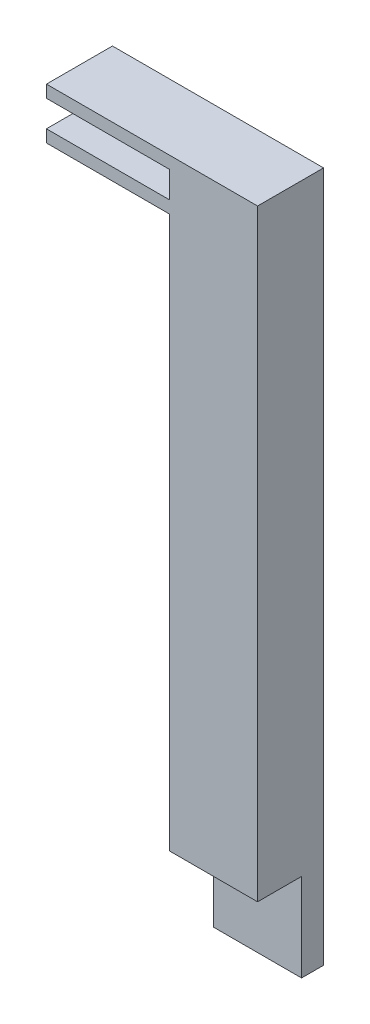
ISO-10303-21;
HEADER;
FILE_DESCRIPTION(('STEP AP214'),'2;1');
FILE_NAME('part.step','',(''),(''),'','','');
FILE_SCHEMA(('AUTOMOTIVE_DESIGN { 1 0 10303 214 1 1 1 1 }'));
ENDSEC;
DATA;
#1=APPLICATION_CONTEXT('core data for automotive mechanical design processes');
#2=APPLICATION_PROTOCOL_DEFINITION('international standard','automotive_design',2000,#1);
#3=PRODUCT_CONTEXT('',#1,'mechanical');
#4=PRODUCT('Part','Part','',(#3));
#5=PRODUCT_RELATED_PRODUCT_CATEGORY('part','',(#4));
#6=PRODUCT_DEFINITION_FORMATION('','',#4);
#7=PRODUCT_DEFINITION_CONTEXT('part definition',#1,'design');
#8=PRODUCT_DEFINITION('design','',#6,#7);
#9=PRODUCT_DEFINITION_SHAPE('','',#8);
#10=(LENGTH_UNIT() NAMED_UNIT(*) SI_UNIT(.MILLI.,.METRE.));
#11=(NAMED_UNIT(*) PLANE_ANGLE_UNIT() SI_UNIT($,.RADIAN.));
#12=(NAMED_UNIT(*) SI_UNIT($,.STERADIAN.) SOLID_ANGLE_UNIT());
#13=UNCERTAINTY_MEASURE_WITH_UNIT(LENGTH_MEASURE(1.E-05),#10,'distance_accuracy_value','');
#14=(GEOMETRIC_REPRESENTATION_CONTEXT(3) GLOBAL_UNCERTAINTY_ASSIGNED_CONTEXT((#13)) GLOBAL_UNIT_ASSIGNED_CONTEXT((#10,
#11,#12)) REPRESENTATION_CONTEXT('',''));
#15=CARTESIAN_POINT('',(0.,0.,0.));
#16=DIRECTION('',(0.,0.,1.));
#17=DIRECTION('',(1.,0.,0.));
#18=AXIS2_PLACEMENT_3D('',#15,#16,#17);
#19=CARTESIAN_POINT('',(-57.15,0.,0.));
#20=DIRECTION('',(1.,0.,0.));
#21=DIRECTION('',(0.,0.,-1.));
#22=AXIS2_PLACEMENT_3D('',#19,#20,#21);
#23=PLANE('',#22);
#24=DIRECTION('',(0.,0.,1.));
#25=VECTOR('',#24,1.);
#26=CARTESIAN_POINT('',(-57.15,108.458,19.05));
#27=LINE('',#26,#25);
#28=CARTESIAN_POINT('',(-57.15,108.458,0.));
#29=VERTEX_POINT('',#28);
#30=CARTESIAN_POINT('',(-57.15,108.458,19.05));
#31=VERTEX_POINT('',#30);
#32=EDGE_CURVE('E233',#29,#31,#27,.T.);
#33=ORIENTED_EDGE('',*,*,#32,.F.);
#34=DIRECTION('',(0.,-1.,0.));
#35=VECTOR('',#34,1.);
#36=CARTESIAN_POINT('',(-57.15,123.19,0.));
#37=LINE('',#36,#35);
#38=CARTESIAN_POINT('',(-57.15,-76.2,0.));
#39=VERTEX_POINT('',#38);
#40=EDGE_CURVE('E151',#29,#39,#37,.T.);
#41=ORIENTED_EDGE('',*,*,#40,.T.);
#42=DIRECTION('',(0.,0.,1.));
#43=VECTOR('',#42,1.);
#44=CARTESIAN_POINT('',(-57.15,-76.2,0.));
#45=LINE('',#44,#43);
#46=CARTESIAN_POINT('',(-57.15,-76.2,6.35));
#47=VERTEX_POINT('',#46);
#48=EDGE_CURVE('E182',#39,#47,#45,.T.);
#49=ORIENTED_EDGE('',*,*,#48,.T.);
#50=DIRECTION('',(0.,1.,0.));
#51=VECTOR('',#50,1.);
#52=CARTESIAN_POINT('',(-57.15,-76.2,6.35));
#53=LINE('',#52,#51);
#54=CARTESIAN_POINT('',(-57.15,-50.8,6.35));
#55=VERTEX_POINT('',#54);
#56=EDGE_CURVE('E184',#47,#55,#53,.T.);
#57=ORIENTED_EDGE('',*,*,#56,.T.);
#58=DIRECTION('',(0.,0.,1.));
#59=VECTOR('',#58,1.);
#60=CARTESIAN_POINT('',(-57.15,-50.8,6.35));
#61=LINE('',#60,#59);
#62=CARTESIAN_POINT('',(-57.15,-50.8,19.05));
#63=VERTEX_POINT('',#62);
#64=EDGE_CURVE('E186',#55,#63,#61,.T.);
#65=ORIENTED_EDGE('',*,*,#64,.T.);
#66=DIRECTION('',(0.,1.,0.));
#67=VECTOR('',#66,1.);
#68=CARTESIAN_POINT('',(-57.15,-50.8,19.05));
#69=LINE('',#68,#67);
#70=EDGE_CURVE('E62',#63,#31,#69,.T.);
#71=ORIENTED_EDGE('',*,*,#70,.T.);
#72=EDGE_LOOP('',(#33,#41,#49,#57,#65,#71));
#73=FACE_BOUND('',#72,.T.);
#74=ADVANCED_FACE('F39',(#73),#23,.F.);
#75=DIRECTION('',(0.,0.,-1.));
#76=VECTOR('',#75,1.);
#77=CARTESIAN_POINT('',(-57.15,112.014,0.));
#78=LINE('',#77,#76);
#79=CARTESIAN_POINT('',(-57.15,112.014,19.05));
#80=VERTEX_POINT('',#79);
#81=CARTESIAN_POINT('',(-57.15,112.014,0.));
#82=VERTEX_POINT('',#81);
#83=EDGE_CURVE('E54',#80,#82,#78,.T.);
#84=ORIENTED_EDGE('',*,*,#83,.F.);
#85=CARTESIAN_POINT('',(-57.15,119.634,19.05));
#86=VERTEX_POINT('',#85);
#87=EDGE_CURVE('E179',#80,#86,#69,.T.);
#88=ORIENTED_EDGE('',*,*,#87,.T.);
#89=DIRECTION('',(0.,0.,1.));
#90=VECTOR('',#89,1.);
#91=CARTESIAN_POINT('',(-57.15,119.634,19.05));
#92=LINE('',#91,#90);
#93=CARTESIAN_POINT('',(-57.15,119.634,0.));
#94=VERTEX_POINT('',#93);
#95=EDGE_CURVE('E152',#94,#86,#92,.T.);
#96=ORIENTED_EDGE('',*,*,#95,.F.);
#97=EDGE_CURVE('E180',#94,#82,#37,.T.);
#98=ORIENTED_EDGE('',*,*,#97,.T.);
#99=EDGE_LOOP('',(#84,#88,#96,#98));
#100=FACE_BOUND('',#99,.T.);
#101=ADVANCED_FACE('F247',(#100),#23,.F.);
#102=CARTESIAN_POINT('',(-57.15,-50.8,19.05));
#103=DIRECTION('',(0.,0.,-1.));
#104=DIRECTION('',(0.,1.,0.));
#105=AXIS2_PLACEMENT_3D('',#102,#103,#104);
#106=PLANE('',#105);
#107=DIRECTION('',(0.,1.,0.));
#108=VECTOR('',#107,1.);
#109=CARTESIAN_POINT('',(-31.75,-50.8,19.05));
#110=LINE('',#109,#108);
#111=CARTESIAN_POINT('',(-31.75,-50.8,19.05));
#112=VERTEX_POINT('',#111);
#113=CARTESIAN_POINT('',(-31.75,123.19,19.05));
#114=VERTEX_POINT('',#113);
#115=EDGE_CURVE('E177',#112,#114,#110,.T.);
#116=ORIENTED_EDGE('',*,*,#115,.T.);
#117=DIRECTION('',(1.,0.,0.));
#118=VECTOR('',#117,1.);
#119=CARTESIAN_POINT('',(-57.15,123.19,19.05));
#120=LINE('',#119,#118);
#121=CARTESIAN_POINT('',(-92.71,123.19,19.05));
#122=VERTEX_POINT('',#121);
#123=EDGE_CURVE('E11',#122,#114,#120,.T.);
#124=ORIENTED_EDGE('',*,*,#123,.F.);
#125=DIRECTION('',(0.,1.,0.));
#126=VECTOR('',#125,1.);
#127=CARTESIAN_POINT('',(-92.71,123.19,19.05));
#128=LINE('',#127,#126);
#129=CARTESIAN_POINT('',(-92.71,119.634,19.05));
#130=VERTEX_POINT('',#129);
#131=EDGE_CURVE('E165',#130,#122,#128,.T.);
#132=ORIENTED_EDGE('',*,*,#131,.F.);
#133=DIRECTION('',(1.,0.,0.));
#134=VECTOR('',#133,1.);
#135=CARTESIAN_POINT('',(-92.71,119.634,19.05));
#136=LINE('',#135,#134);
#137=EDGE_CURVE('E170',#130,#86,#136,.T.);
#138=ORIENTED_EDGE('',*,*,#137,.T.);
#139=ORIENTED_EDGE('',*,*,#87,.F.);
#140=DIRECTION('',(1.,0.,0.));
#141=VECTOR('',#140,1.);
#142=CARTESIAN_POINT('',(-92.71,112.014,19.05));
#143=LINE('',#142,#141);
#144=CARTESIAN_POINT('',(-92.71,112.014,19.05));
#145=VERTEX_POINT('',#144);
#146=EDGE_CURVE('E157',#145,#80,#143,.T.);
#147=ORIENTED_EDGE('',*,*,#146,.F.);
#148=DIRECTION('',(0.,1.,0.));
#149=VECTOR('',#148,1.);
#150=CARTESIAN_POINT('',(-92.71,112.014,19.05));
#151=LINE('',#150,#149);
#152=CARTESIAN_POINT('',(-92.71,108.458,19.05));
#153=VERTEX_POINT('',#152);
#154=EDGE_CURVE('E138',#153,#145,#151,.T.);
#155=ORIENTED_EDGE('',*,*,#154,.F.);
#156=DIRECTION('',(1.,0.,0.));
#157=VECTOR('',#156,1.);
#158=CARTESIAN_POINT('',(-92.71,108.458,19.05));
#159=LINE('',#158,#157);
#160=EDGE_CURVE('E135',#153,#31,#159,.T.);
#161=ORIENTED_EDGE('',*,*,#160,.T.);
#162=ORIENTED_EDGE('',*,*,#70,.F.);
#163=DIRECTION('',(1.,0.,0.));
#164=VECTOR('',#163,1.);
#165=CARTESIAN_POINT('',(-57.15,-50.8,19.05));
#166=LINE('',#165,#164);
#167=EDGE_CURVE('E188',#63,#112,#166,.T.);
#168=ORIENTED_EDGE('',*,*,#167,.T.);
#169=EDGE_LOOP('',(#116,#124,#132,#138,#139,#147,#155,#161,#162,#168));
#170=FACE_BOUND('',#169,.T.);
#171=ADVANCED_FACE('F41',(#170),#106,.F.);
#172=CARTESIAN_POINT('',(-57.15,123.19,0.));
#173=DIRECTION('',(0.,-1.,0.));
#174=DIRECTION('',(0.,0.,-1.));
#175=AXIS2_PLACEMENT_3D('',#172,#173,#174);
#176=PLANE('',#175);
#177=DIRECTION('',(0.,0.,-1.));
#178=VECTOR('',#177,1.);
#179=CARTESIAN_POINT('',(-31.75,123.19,0.));
#180=LINE('',#179,#178);
#181=CARTESIAN_POINT('',(-31.75,123.19,0.));
#182=VERTEX_POINT('',#181);
#183=EDGE_CURVE('E191',#114,#182,#180,.T.);
#184=ORIENTED_EDGE('',*,*,#183,.T.);
#185=DIRECTION('',(1.,0.,0.));
#186=VECTOR('',#185,1.);
#187=CARTESIAN_POINT('',(-57.15,123.19,0.));
#188=LINE('',#187,#186);
#189=CARTESIAN_POINT('',(-92.71,123.19,0.));
#190=VERTEX_POINT('',#189);
#191=EDGE_CURVE('E47',#190,#182,#188,.T.);
#192=ORIENTED_EDGE('',*,*,#191,.F.);
#193=DIRECTION('',(0.,0.,-1.));
#194=VECTOR('',#193,1.);
#195=CARTESIAN_POINT('',(-92.71,123.19,0.));
#196=LINE('',#195,#194);
#197=EDGE_CURVE('E168',#122,#190,#196,.T.);
#198=ORIENTED_EDGE('',*,*,#197,.F.);
#199=ORIENTED_EDGE('',*,*,#123,.T.);
#200=EDGE_LOOP('',(#184,#192,#198,#199));
#201=FACE_BOUND('',#200,.T.);
#202=ADVANCED_FACE('F253',(#201),#176,.F.);
#203=CARTESIAN_POINT('',(-57.15,123.19,0.));
#204=DIRECTION('',(0.,0.,1.));
#205=DIRECTION('',(0.,-1.,0.));
#206=AXIS2_PLACEMENT_3D('',#203,#204,#205);
#207=PLANE('',#206);
#208=DIRECTION('',(0.,-1.,0.));
#209=VECTOR('',#208,1.);
#210=CARTESIAN_POINT('',(-31.75,123.19,0.));
#211=LINE('',#210,#209);
#212=CARTESIAN_POINT('',(-31.75,-76.2,0.));
#213=VERTEX_POINT('',#212);
#214=EDGE_CURVE('E193',#182,#213,#211,.T.);
#215=ORIENTED_EDGE('',*,*,#214,.T.);
#216=DIRECTION('',(1.,0.,0.));
#217=VECTOR('',#216,1.);
#218=CARTESIAN_POINT('',(-57.15,-76.2,0.));
#219=LINE('',#218,#217);
#220=EDGE_CURVE('E209',#39,#213,#219,.T.);
#221=ORIENTED_EDGE('',*,*,#220,.F.);
#222=ORIENTED_EDGE('',*,*,#40,.F.);
#223=DIRECTION('',(1.,0.,0.));
#224=VECTOR('',#223,1.);
#225=CARTESIAN_POINT('',(-92.71,108.458,0.));
#226=LINE('',#225,#224);
#227=CARTESIAN_POINT('',(-92.71,108.458,0.));
#228=VERTEX_POINT('',#227);
#229=EDGE_CURVE('E133',#228,#29,#226,.T.);
#230=ORIENTED_EDGE('',*,*,#229,.F.);
#231=DIRECTION('',(0.,-1.,0.));
#232=VECTOR('',#231,1.);
#233=CARTESIAN_POINT('',(-92.71,108.458,0.));
#234=LINE('',#233,#232);
#235=CARTESIAN_POINT('',(-92.71,112.014,0.));
#236=VERTEX_POINT('',#235);
#237=EDGE_CURVE('E139',#236,#228,#234,.T.);
#238=ORIENTED_EDGE('',*,*,#237,.F.);
#239=DIRECTION('',(1.,0.,0.));
#240=VECTOR('',#239,1.);
#241=CARTESIAN_POINT('',(-92.71,112.014,0.));
#242=LINE('',#241,#240);
#243=EDGE_CURVE('E239',#236,#82,#242,.T.);
#244=ORIENTED_EDGE('',*,*,#243,.T.);
#245=ORIENTED_EDGE('',*,*,#97,.F.);
#246=DIRECTION('',(1.,0.,0.));
#247=VECTOR('',#246,1.);
#248=CARTESIAN_POINT('',(-92.71,119.634,0.));
#249=LINE('',#248,#247);
#250=CARTESIAN_POINT('',(-92.71,119.634,0.));
#251=VERTEX_POINT('',#250);
#252=EDGE_CURVE('E174',#251,#94,#249,.T.);
#253=ORIENTED_EDGE('',*,*,#252,.F.);
#254=DIRECTION('',(0.,-1.,0.));
#255=VECTOR('',#254,1.);
#256=CARTESIAN_POINT('',(-92.71,119.634,0.));
#257=LINE('',#256,#255);
#258=EDGE_CURVE('E155',#190,#251,#257,.T.);
#259=ORIENTED_EDGE('',*,*,#258,.F.);
#260=ORIENTED_EDGE('',*,*,#191,.T.);
#261=EDGE_LOOP('',(#215,#221,#222,#230,#238,#244,#245,#253,#259,#260));
#262=FACE_BOUND('',#261,.T.);
#263=ADVANCED_FACE('F149',(#262),#207,.F.);
#264=CARTESIAN_POINT('',(-57.15,-76.2,0.));
#265=DIRECTION('',(0.,1.,0.));
#266=DIRECTION('',(0.,0.,1.));
#267=AXIS2_PLACEMENT_3D('',#264,#265,#266);
#268=PLANE('',#267);
#269=DIRECTION('',(0.,0.,1.));
#270=VECTOR('',#269,1.);
#271=CARTESIAN_POINT('',(-31.75,-76.2,0.));
#272=LINE('',#271,#270);
#273=CARTESIAN_POINT('',(-31.75,-76.2,6.35));
#274=VERTEX_POINT('',#273);
#275=EDGE_CURVE('E195',#213,#274,#272,.T.);
#276=ORIENTED_EDGE('',*,*,#275,.T.);
#277=DIRECTION('',(1.,0.,0.));
#278=VECTOR('',#277,1.);
#279=CARTESIAN_POINT('',(-57.15,-76.2,6.35));
#280=LINE('',#279,#278);
#281=EDGE_CURVE('E206',#47,#274,#280,.T.);
#282=ORIENTED_EDGE('',*,*,#281,.F.);
#283=ORIENTED_EDGE('',*,*,#48,.F.);
#284=ORIENTED_EDGE('',*,*,#220,.T.);
#285=EDGE_LOOP('',(#276,#282,#283,#284));
#286=FACE_BOUND('',#285,.T.);
#287=ADVANCED_FACE('F225',(#286),#268,.F.);
#288=CARTESIAN_POINT('',(-57.15,-76.2,6.35));
#289=DIRECTION('',(0.,0.,-1.));
#290=DIRECTION('',(-1.,0.,0.));
#291=AXIS2_PLACEMENT_3D('',#288,#289,#290);
#292=PLANE('',#291);
#293=DIRECTION('',(0.,1.,0.));
#294=VECTOR('',#293,1.);
#295=CARTESIAN_POINT('',(-31.75,-76.2,6.35));
#296=LINE('',#295,#294);
#297=CARTESIAN_POINT('',(-31.75,-50.8,6.35));
#298=VERTEX_POINT('',#297);
#299=EDGE_CURVE('E197',#274,#298,#296,.T.);
#300=ORIENTED_EDGE('',*,*,#299,.T.);
#301=DIRECTION('',(1.,0.,0.));
#302=VECTOR('',#301,1.);
#303=CARTESIAN_POINT('',(-57.15,-50.8,6.35));
#304=LINE('',#303,#302);
#305=EDGE_CURVE('E203',#55,#298,#304,.T.);
#306=ORIENTED_EDGE('',*,*,#305,.F.);
#307=ORIENTED_EDGE('',*,*,#56,.F.);
#308=ORIENTED_EDGE('',*,*,#281,.T.);
#309=EDGE_LOOP('',(#300,#306,#307,#308));
#310=FACE_BOUND('',#309,.T.);
#311=ADVANCED_FACE('F229',(#310),#292,.F.);
#312=CARTESIAN_POINT('',(-57.15,-50.8,6.35));
#313=DIRECTION('',(0.,1.,0.));
#314=DIRECTION('',(0.,0.,1.));
#315=AXIS2_PLACEMENT_3D('',#312,#313,#314);
#316=PLANE('',#315);
#317=DIRECTION('',(0.,0.,1.));
#318=VECTOR('',#317,1.);
#319=CARTESIAN_POINT('',(-31.75,-50.8,6.35));
#320=LINE('',#319,#318);
#321=EDGE_CURVE('E199',#298,#112,#320,.T.);
#322=ORIENTED_EDGE('',*,*,#321,.T.);
#323=ORIENTED_EDGE('',*,*,#167,.F.);
#324=ORIENTED_EDGE('',*,*,#64,.F.);
#325=ORIENTED_EDGE('',*,*,#305,.T.);
#326=EDGE_LOOP('',(#322,#323,#324,#325));
#327=FACE_BOUND('',#326,.T.);
#328=ADVANCED_FACE('F255',(#327),#316,.F.);
#329=CARTESIAN_POINT('',(-31.75,0.,0.));
#330=DIRECTION('',(1.,0.,0.));
#331=DIRECTION('',(0.,0.,-1.));
#332=AXIS2_PLACEMENT_3D('',#329,#330,#331);
#333=PLANE('',#332);
#334=ORIENTED_EDGE('',*,*,#115,.F.);
#335=ORIENTED_EDGE('',*,*,#321,.F.);
#336=ORIENTED_EDGE('',*,*,#299,.F.);
#337=ORIENTED_EDGE('',*,*,#275,.F.);
#338=ORIENTED_EDGE('',*,*,#214,.F.);
#339=ORIENTED_EDGE('',*,*,#183,.F.);
#340=EDGE_LOOP('',(#334,#335,#336,#337,#338,#339));
#341=FACE_BOUND('',#340,.T.);
#342=ADVANCED_FACE('F220',(#341),#333,.T.);
#343=CARTESIAN_POINT('',(-92.71,119.634,19.05));
#344=DIRECTION('',(0.,1.,0.));
#345=DIRECTION('',(0.,0.,1.));
#346=AXIS2_PLACEMENT_3D('',#343,#344,#345);
#347=PLANE('',#346);
#348=ORIENTED_EDGE('',*,*,#95,.T.);
#349=ORIENTED_EDGE('',*,*,#137,.F.);
#350=DIRECTION('',(0.,0.,1.));
#351=VECTOR('',#350,1.);
#352=CARTESIAN_POINT('',(-92.71,119.634,19.05));
#353=LINE('',#352,#351);
#354=EDGE_CURVE('E163',#251,#130,#353,.T.);
#355=ORIENTED_EDGE('',*,*,#354,.F.);
#356=ORIENTED_EDGE('',*,*,#252,.T.);
#357=EDGE_LOOP('',(#348,#349,#355,#356));
#358=FACE_BOUND('',#357,.T.);
#359=ADVANCED_FACE('F250',(#358),#347,.F.);
#360=CARTESIAN_POINT('',(-92.71,0.,0.));
#361=DIRECTION('',(1.,0.,0.));
#362=DIRECTION('',(0.,0.,-1.));
#363=AXIS2_PLACEMENT_3D('',#360,#361,#362);
#364=PLANE('',#363);
#365=ORIENTED_EDGE('',*,*,#258,.T.);
#366=ORIENTED_EDGE('',*,*,#354,.T.);
#367=ORIENTED_EDGE('',*,*,#131,.T.);
#368=ORIENTED_EDGE('',*,*,#197,.T.);
#369=EDGE_LOOP('',(#365,#366,#367,#368));
#370=FACE_BOUND('',#369,.T.);
#371=ADVANCED_FACE('F252',(#370),#364,.F.);
#372=CARTESIAN_POINT('',(-92.71,108.458,19.05));
#373=DIRECTION('',(0.,1.,0.));
#374=DIRECTION('',(0.,0.,1.));
#375=AXIS2_PLACEMENT_3D('',#372,#373,#374);
#376=PLANE('',#375);
#377=ORIENTED_EDGE('',*,*,#32,.T.);
#378=ORIENTED_EDGE('',*,*,#160,.F.);
#379=DIRECTION('',(0.,0.,1.));
#380=VECTOR('',#379,1.);
#381=CARTESIAN_POINT('',(-92.71,108.458,19.05));
#382=LINE('',#381,#380);
#383=EDGE_CURVE('E129',#228,#153,#382,.T.);
#384=ORIENTED_EDGE('',*,*,#383,.F.);
#385=ORIENTED_EDGE('',*,*,#229,.T.);
#386=EDGE_LOOP('',(#377,#378,#384,#385));
#387=FACE_BOUND('',#386,.T.);
#388=ADVANCED_FACE('F131',(#387),#376,.F.);
#389=CARTESIAN_POINT('',(-92.71,112.014,0.));
#390=DIRECTION('',(0.,-1.,0.));
#391=DIRECTION('',(0.,0.,-1.));
#392=AXIS2_PLACEMENT_3D('',#389,#390,#391);
#393=PLANE('',#392);
#394=ORIENTED_EDGE('',*,*,#83,.T.);
#395=ORIENTED_EDGE('',*,*,#243,.F.);
#396=DIRECTION('',(0.,0.,-1.));
#397=VECTOR('',#396,1.);
#398=CARTESIAN_POINT('',(-92.71,112.014,0.));
#399=LINE('',#398,#397);
#400=EDGE_CURVE('E144',#145,#236,#399,.T.);
#401=ORIENTED_EDGE('',*,*,#400,.F.);
#402=ORIENTED_EDGE('',*,*,#146,.T.);
#403=EDGE_LOOP('',(#394,#395,#401,#402));
#404=FACE_BOUND('',#403,.T.);
#405=ADVANCED_FACE('F243',(#404),#393,.F.);
#406=CARTESIAN_POINT('',(-92.71,0.,0.));
#407=DIRECTION('',(1.,0.,0.));
#408=DIRECTION('',(0.,0.,-1.));
#409=AXIS2_PLACEMENT_3D('',#406,#407,#408);
#410=PLANE('',#409);
#411=ORIENTED_EDGE('',*,*,#237,.T.);
#412=ORIENTED_EDGE('',*,*,#383,.T.);
#413=ORIENTED_EDGE('',*,*,#154,.T.);
#414=ORIENTED_EDGE('',*,*,#400,.T.);
#415=EDGE_LOOP('',(#411,#412,#413,#414));
#416=FACE_BOUND('',#415,.T.);
#417=ADVANCED_FACE('F142',(#416),#410,.F.);
#418=CLOSED_SHELL('',(#74,#101,#171,#202,#263,#287,#311,#328,#342,#359,#371,#388,#405,#417));
#419=MANIFOLD_SOLID_BREP('B2',#418);
#420=ADVANCED_BREP_SHAPE_REPRESENTATION('',(#18,#419),#14);
#421=SHAPE_DEFINITION_REPRESENTATION(#9,#420);
ENDSEC;
END-ISO-10303-21;
